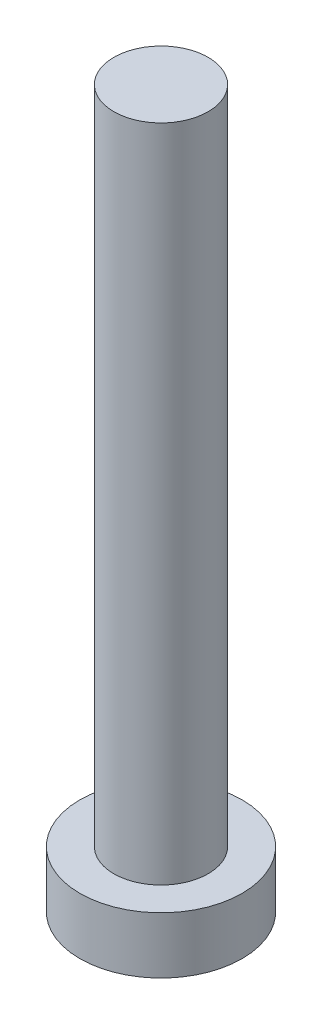
ISO-10303-21;
HEADER;
FILE_DESCRIPTION(('STEP AP214'),'2;1');
FILE_NAME('part.step','',(''),(''),'','','');
FILE_SCHEMA(('AUTOMOTIVE_DESIGN { 1 0 10303 214 1 1 1 1 }'));
ENDSEC;
DATA;
#1=APPLICATION_CONTEXT('core data for automotive mechanical design processes');
#2=APPLICATION_PROTOCOL_DEFINITION('international standard','automotive_design',2000,#1);
#3=PRODUCT_CONTEXT('',#1,'mechanical');
#4=PRODUCT('Part','Part','',(#3));
#5=PRODUCT_RELATED_PRODUCT_CATEGORY('part','',(#4));
#6=PRODUCT_DEFINITION_FORMATION('','',#4);
#7=PRODUCT_DEFINITION_CONTEXT('part definition',#1,'design');
#8=PRODUCT_DEFINITION('design','',#6,#7);
#9=PRODUCT_DEFINITION_SHAPE('','',#8);
#10=(LENGTH_UNIT() NAMED_UNIT(*) SI_UNIT(.MILLI.,.METRE.));
#11=(NAMED_UNIT(*) PLANE_ANGLE_UNIT() SI_UNIT($,.RADIAN.));
#12=(NAMED_UNIT(*) SI_UNIT($,.STERADIAN.) SOLID_ANGLE_UNIT());
#13=UNCERTAINTY_MEASURE_WITH_UNIT(LENGTH_MEASURE(1.E-05),#10,'distance_accuracy_value','');
#14=(GEOMETRIC_REPRESENTATION_CONTEXT(3) GLOBAL_UNCERTAINTY_ASSIGNED_CONTEXT((#13)) GLOBAL_UNIT_ASSIGNED_CONTEXT((#10,
#11,#12)) REPRESENTATION_CONTEXT('',''));
#15=CARTESIAN_POINT('',(0.,0.,0.));
#16=DIRECTION('',(0.,0.,1.));
#17=DIRECTION('',(1.,0.,0.));
#18=AXIS2_PLACEMENT_3D('',#15,#16,#17);
#19=CARTESIAN_POINT('',(0.,0.,0.));
#20=DIRECTION('',(0.,1.,0.));
#21=DIRECTION('',(0.,0.,1.));
#22=AXIS2_PLACEMENT_3D('',#19,#20,#21);
#23=PLANE('',#22);
#24=CARTESIAN_POINT('',(0.,0.,0.));
#25=DIRECTION('',(0.,1.,0.));
#26=DIRECTION('',(0.,0.,1.));
#27=AXIS2_PLACEMENT_3D('',#24,#25,#26);
#28=CIRCLE('',#27,4.3);
#29=CARTESIAN_POINT('',(0.,0.,4.3));
#30=VERTEX_POINT('',#29);
#31=EDGE_CURVE('E39',#30,#30,#28,.T.);
#32=ORIENTED_EDGE('',*,*,#31,.F.);
#33=EDGE_LOOP('',(#32));
#34=FACE_BOUND('',#33,.T.);
#35=CARTESIAN_POINT('',(1.1,0.,1.1));
#36=DIRECTION('',(0.,1.,0.));
#37=DIRECTION('',(0.,0.,-1.));
#38=AXIS2_PLACEMENT_3D('',#35,#36,#37);
#39=CIRCLE('',#38,0.5);
#40=CARTESIAN_POINT('',(1.1,0.,0.6));
#41=VERTEX_POINT('',#40);
#42=CARTESIAN_POINT('',(0.6,0.,1.1));
#43=VERTEX_POINT('',#42);
#44=EDGE_CURVE('E186',#41,#43,#39,.T.);
#45=ORIENTED_EDGE('',*,*,#44,.F.);
#46=DIRECTION('',(-1.,0.,0.));
#47=VECTOR('',#46,1.);
#48=CARTESIAN_POINT('',(1.1,0.,0.6));
#49=LINE('',#48,#47);
#50=CARTESIAN_POINT('',(2.4,0.,0.6));
#51=VERTEX_POINT('',#50);
#52=EDGE_CURVE('E52',#51,#41,#49,.T.);
#53=ORIENTED_EDGE('',*,*,#52,.F.);
#54=DIRECTION('',(0.,0.,1.));
#55=VECTOR('',#54,1.);
#56=CARTESIAN_POINT('',(2.4,0.,-0.6));
#57=LINE('',#56,#55);
#58=CARTESIAN_POINT('',(2.4,0.,-0.6));
#59=VERTEX_POINT('',#58);
#60=EDGE_CURVE('E225',#59,#51,#57,.T.);
#61=ORIENTED_EDGE('',*,*,#60,.F.);
#62=DIRECTION('',(1.,0.,0.));
#63=VECTOR('',#62,1.);
#64=CARTESIAN_POINT('',(1.1,0.,-0.6));
#65=LINE('',#64,#63);
#66=CARTESIAN_POINT('',(1.1,0.,-0.6));
#67=VERTEX_POINT('',#66);
#68=EDGE_CURVE('E223',#67,#59,#65,.T.);
#69=ORIENTED_EDGE('',*,*,#68,.F.);
#70=CARTESIAN_POINT('',(1.1,0.,-1.1));
#71=DIRECTION('',(0.,1.,0.));
#72=DIRECTION('',(0.,0.,-1.));
#73=AXIS2_PLACEMENT_3D('',#70,#71,#72);
#74=CIRCLE('',#73,0.5);
#75=CARTESIAN_POINT('',(0.600000000000001,0.,-1.1));
#76=VERTEX_POINT('',#75);
#77=EDGE_CURVE('E160',#76,#67,#74,.T.);
#78=ORIENTED_EDGE('',*,*,#77,.F.);
#79=DIRECTION('',(0.,0.,1.));
#80=VECTOR('',#79,1.);
#81=CARTESIAN_POINT('',(0.600000000000001,0.,-2.4));
#82=LINE('',#81,#80);
#83=CARTESIAN_POINT('',(0.600000000000001,0.,-2.4));
#84=VERTEX_POINT('',#83);
#85=EDGE_CURVE('E219',#84,#76,#82,.T.);
#86=ORIENTED_EDGE('',*,*,#85,.F.);
#87=DIRECTION('',(1.,0.,0.));
#88=VECTOR('',#87,1.);
#89=CARTESIAN_POINT('',(-0.599999999999999,0.,-2.4));
#90=LINE('',#89,#88);
#91=CARTESIAN_POINT('',(-0.599999999999999,0.,-2.4));
#92=VERTEX_POINT('',#91);
#93=EDGE_CURVE('E216',#92,#84,#90,.T.);
#94=ORIENTED_EDGE('',*,*,#93,.F.);
#95=DIRECTION('',(0.,0.,-1.));
#96=VECTOR('',#95,1.);
#97=CARTESIAN_POINT('',(-0.599999999999999,0.,-2.4));
#98=LINE('',#97,#96);
#99=CARTESIAN_POINT('',(-0.599999999999999,0.,-1.1));
#100=VERTEX_POINT('',#99);
#101=EDGE_CURVE('E213',#100,#92,#98,.T.);
#102=ORIENTED_EDGE('',*,*,#101,.F.);
#103=CARTESIAN_POINT('',(-1.1,0.,-1.1));
#104=DIRECTION('',(0.,1.,0.));
#105=DIRECTION('',(0.,0.,-1.));
#106=AXIS2_PLACEMENT_3D('',#103,#104,#105);
#107=CIRCLE('',#106,0.5);
#108=CARTESIAN_POINT('',(-1.1,0.,-0.6));
#109=VERTEX_POINT('',#108);
#110=EDGE_CURVE('E210',#109,#100,#107,.T.);
#111=ORIENTED_EDGE('',*,*,#110,.F.);
#112=DIRECTION('',(1.,0.,0.));
#113=VECTOR('',#112,1.);
#114=CARTESIAN_POINT('',(-2.4,0.,-0.6));
#115=LINE('',#114,#113);
#116=CARTESIAN_POINT('',(-2.4,0.,-0.6));
#117=VERTEX_POINT('',#116);
#118=EDGE_CURVE('E207',#117,#109,#115,.T.);
#119=ORIENTED_EDGE('',*,*,#118,.F.);
#120=DIRECTION('',(0.,0.,-1.));
#121=VECTOR('',#120,1.);
#122=CARTESIAN_POINT('',(-2.4,0.,-0.6));
#123=LINE('',#122,#121);
#124=CARTESIAN_POINT('',(-2.4,0.,0.6));
#125=VERTEX_POINT('',#124);
#126=EDGE_CURVE('E204',#125,#117,#123,.T.);
#127=ORIENTED_EDGE('',*,*,#126,.F.);
#128=DIRECTION('',(-1.,0.,0.));
#129=VECTOR('',#128,1.);
#130=CARTESIAN_POINT('',(-2.4,0.,0.6));
#131=LINE('',#130,#129);
#132=CARTESIAN_POINT('',(-1.1,0.,0.6));
#133=VERTEX_POINT('',#132);
#134=EDGE_CURVE('E201',#133,#125,#131,.T.);
#135=ORIENTED_EDGE('',*,*,#134,.F.);
#136=CARTESIAN_POINT('',(-1.1,0.,1.1));
#137=DIRECTION('',(0.,1.,0.));
#138=DIRECTION('',(0.,0.,1.));
#139=AXIS2_PLACEMENT_3D('',#136,#137,#138);
#140=CIRCLE('',#139,0.5);
#141=CARTESIAN_POINT('',(-0.599999999999999,0.,1.1));
#142=VERTEX_POINT('',#141);
#143=EDGE_CURVE('E198',#142,#133,#140,.T.);
#144=ORIENTED_EDGE('',*,*,#143,.F.);
#145=DIRECTION('',(0.,0.,-1.));
#146=VECTOR('',#145,1.);
#147=CARTESIAN_POINT('',(-0.599999999999999,0.,1.1));
#148=LINE('',#147,#146);
#149=CARTESIAN_POINT('',(-0.599999999999999,0.,2.4));
#150=VERTEX_POINT('',#149);
#151=EDGE_CURVE('E195',#150,#142,#148,.T.);
#152=ORIENTED_EDGE('',*,*,#151,.F.);
#153=DIRECTION('',(-1.,0.,0.));
#154=VECTOR('',#153,1.);
#155=CARTESIAN_POINT('',(-0.599999999999999,0.,2.4));
#156=LINE('',#155,#154);
#157=CARTESIAN_POINT('',(0.600000000000001,0.,2.4));
#158=VERTEX_POINT('',#157);
#159=EDGE_CURVE('E192',#158,#150,#156,.T.);
#160=ORIENTED_EDGE('',*,*,#159,.F.);
#161=DIRECTION('',(0.,0.,1.));
#162=VECTOR('',#161,1.);
#163=CARTESIAN_POINT('',(0.6,0.,1.1));
#164=LINE('',#163,#162);
#165=EDGE_CURVE('E189',#43,#158,#164,.T.);
#166=ORIENTED_EDGE('',*,*,#165,.F.);
#167=EDGE_LOOP('',(#45,#53,#61,#69,#78,#86,#94,#102,#111,#119,#127,#135,#144,#152,#160,#166));
#168=FACE_BOUND('',#167,.T.);
#169=ADVANCED_FACE('F35',(#34,#168),#23,.F.);
#170=CARTESIAN_POINT('',(0.,3.,0.));
#171=DIRECTION('',(0.,-1.,0.));
#172=DIRECTION('',(0.,0.,-1.));
#173=AXIS2_PLACEMENT_3D('',#170,#171,#172);
#174=CYLINDRICAL_SURFACE('',#173,4.3);
#175=CARTESIAN_POINT('',(0.,3.,0.));
#176=DIRECTION('',(0.,1.,0.));
#177=DIRECTION('',(0.,0.,1.));
#178=AXIS2_PLACEMENT_3D('',#175,#176,#177);
#179=CIRCLE('',#178,4.3);
#180=CARTESIAN_POINT('',(0.,3.,4.3));
#181=VERTEX_POINT('',#180);
#182=EDGE_CURVE('E44',#181,#181,#179,.T.);
#183=ORIENTED_EDGE('',*,*,#182,.F.);
#184=EDGE_LOOP('',(#183));
#185=FACE_BOUND('',#184,.T.);
#186=ORIENTED_EDGE('',*,*,#31,.T.);
#187=EDGE_LOOP('',(#186));
#188=FACE_BOUND('',#187,.T.);
#189=ADVANCED_FACE('F37',(#185,#188),#174,.T.);
#190=CARTESIAN_POINT('',(0.,3.,0.));
#191=DIRECTION('',(0.,1.,0.));
#192=DIRECTION('',(0.,0.,1.));
#193=AXIS2_PLACEMENT_3D('',#190,#191,#192);
#194=PLANE('',#193);
#195=CARTESIAN_POINT('',(0.,3.,0.));
#196=DIRECTION('',(0.,1.,0.));
#197=DIRECTION('',(0.,0.,1.));
#198=AXIS2_PLACEMENT_3D('',#195,#196,#197);
#199=CIRCLE('',#198,2.5);
#200=CARTESIAN_POINT('',(0.,3.,2.5));
#201=VERTEX_POINT('',#200);
#202=EDGE_CURVE('E11',#201,#201,#199,.T.);
#203=ORIENTED_EDGE('',*,*,#202,.F.);
#204=EDGE_LOOP('',(#203));
#205=FACE_BOUND('',#204,.T.);
#206=ORIENTED_EDGE('',*,*,#182,.T.);
#207=EDGE_LOOP('',(#206));
#208=FACE_BOUND('',#207,.T.);
#209=ADVANCED_FACE('F374',(#205,#208),#194,.T.);
#210=CARTESIAN_POINT('',(0.,38.,0.));
#211=DIRECTION('',(0.,-1.,0.));
#212=DIRECTION('',(0.,0.,-1.));
#213=AXIS2_PLACEMENT_3D('',#210,#211,#212);
#214=CYLINDRICAL_SURFACE('',#213,2.5);
#215=CARTESIAN_POINT('',(0.,38.,0.));
#216=DIRECTION('',(0.,1.,0.));
#217=DIRECTION('',(0.,0.,1.));
#218=AXIS2_PLACEMENT_3D('',#215,#216,#217);
#219=CIRCLE('',#218,2.5);
#220=CARTESIAN_POINT('',(0.,38.,2.5));
#221=VERTEX_POINT('',#220);
#222=EDGE_CURVE('E229',#221,#221,#219,.T.);
#223=ORIENTED_EDGE('',*,*,#222,.F.);
#224=EDGE_LOOP('',(#223));
#225=FACE_BOUND('',#224,.T.);
#226=ORIENTED_EDGE('',*,*,#202,.T.);
#227=EDGE_LOOP('',(#226));
#228=FACE_BOUND('',#227,.T.);
#229=ADVANCED_FACE('F370',(#225,#228),#214,.T.);
#230=CARTESIAN_POINT('',(0.,38.,0.));
#231=DIRECTION('',(0.,1.,0.));
#232=DIRECTION('',(0.,0.,1.));
#233=AXIS2_PLACEMENT_3D('',#230,#231,#232);
#234=PLANE('',#233);
#235=ORIENTED_EDGE('',*,*,#222,.T.);
#236=EDGE_LOOP('',(#235));
#237=FACE_BOUND('',#236,.T.);
#238=ADVANCED_FACE('F320',(#237),#234,.T.);
#239=CARTESIAN_POINT('',(1.1,1.5,0.6));
#240=DIRECTION('',(0.,0.,1.));
#241=DIRECTION('',(1.,0.,0.));
#242=AXIS2_PLACEMENT_3D('',#239,#240,#241);
#243=PLANE('',#242);
#244=ORIENTED_EDGE('',*,*,#52,.T.);
#245=DIRECTION('',(0.,-1.,0.));
#246=VECTOR('',#245,1.);
#247=CARTESIAN_POINT('',(1.1,1.5,0.6));
#248=LINE('',#247,#246);
#249=CARTESIAN_POINT('',(1.1,1.5,0.6));
#250=VERTEX_POINT('',#249);
#251=EDGE_CURVE('E112',#250,#41,#248,.T.);
#252=ORIENTED_EDGE('',*,*,#251,.F.);
#253=DIRECTION('',(-1.,0.,0.));
#254=VECTOR('',#253,1.);
#255=CARTESIAN_POINT('',(1.1,1.5,0.6));
#256=LINE('',#255,#254);
#257=CARTESIAN_POINT('',(2.4,1.5,0.6));
#258=VERTEX_POINT('',#257);
#259=EDGE_CURVE('E227',#258,#250,#256,.T.);
#260=ORIENTED_EDGE('',*,*,#259,.F.);
#261=DIRECTION('',(0.,-1.,0.));
#262=VECTOR('',#261,1.);
#263=CARTESIAN_POINT('',(2.4,1.5,0.6));
#264=LINE('',#263,#262);
#265=EDGE_CURVE('E60',#258,#51,#264,.T.);
#266=ORIENTED_EDGE('',*,*,#265,.T.);
#267=EDGE_LOOP('',(#244,#252,#260,#266));
#268=FACE_BOUND('',#267,.T.);
#269=ADVANCED_FACE('F313',(#268),#243,.F.);
#270=CARTESIAN_POINT('',(2.4,1.5,-0.6));
#271=DIRECTION('',(1.,0.,0.));
#272=DIRECTION('',(0.,0.,-1.));
#273=AXIS2_PLACEMENT_3D('',#270,#271,#272);
#274=PLANE('',#273);
#275=ORIENTED_EDGE('',*,*,#60,.T.);
#276=ORIENTED_EDGE('',*,*,#265,.F.);
#277=DIRECTION('',(0.,0.,1.));
#278=VECTOR('',#277,1.);
#279=CARTESIAN_POINT('',(2.4,1.5,-0.6));
#280=LINE('',#279,#278);
#281=CARTESIAN_POINT('',(2.4,1.5,-0.6));
#282=VERTEX_POINT('',#281);
#283=EDGE_CURVE('E172',#282,#258,#280,.T.);
#284=ORIENTED_EDGE('',*,*,#283,.F.);
#285=DIRECTION('',(0.,-1.,0.));
#286=VECTOR('',#285,1.);
#287=CARTESIAN_POINT('',(2.4,1.5,-0.6));
#288=LINE('',#287,#286);
#289=EDGE_CURVE('E164',#282,#59,#288,.T.);
#290=ORIENTED_EDGE('',*,*,#289,.T.);
#291=EDGE_LOOP('',(#275,#276,#284,#290));
#292=FACE_BOUND('',#291,.T.);
#293=ADVANCED_FACE('F311',(#292),#274,.F.);
#294=CARTESIAN_POINT('',(1.1,1.5,-0.6));
#295=DIRECTION('',(0.,0.,-1.));
#296=DIRECTION('',(-1.,0.,0.));
#297=AXIS2_PLACEMENT_3D('',#294,#295,#296);
#298=PLANE('',#297);
#299=ORIENTED_EDGE('',*,*,#68,.T.);
#300=ORIENTED_EDGE('',*,*,#289,.F.);
#301=DIRECTION('',(1.,0.,0.));
#302=VECTOR('',#301,1.);
#303=CARTESIAN_POINT('',(1.1,1.5,-0.6));
#304=LINE('',#303,#302);
#305=CARTESIAN_POINT('',(1.1,1.5,-0.6));
#306=VERTEX_POINT('',#305);
#307=EDGE_CURVE('E168',#306,#282,#304,.T.);
#308=ORIENTED_EDGE('',*,*,#307,.F.);
#309=DIRECTION('',(0.,-1.,0.));
#310=VECTOR('',#309,1.);
#311=CARTESIAN_POINT('',(1.1,1.5,-0.6));
#312=LINE('',#311,#310);
#313=EDGE_CURVE('E153',#306,#67,#312,.T.);
#314=ORIENTED_EDGE('',*,*,#313,.T.);
#315=EDGE_LOOP('',(#299,#300,#308,#314));
#316=FACE_BOUND('',#315,.T.);
#317=ADVANCED_FACE('F169',(#316),#298,.F.);
#318=CARTESIAN_POINT('',(1.1,1.5,-1.1));
#319=DIRECTION('',(0.,-1.,0.));
#320=DIRECTION('',(0.,0.,-1.));
#321=AXIS2_PLACEMENT_3D('',#318,#319,#320);
#322=CYLINDRICAL_SURFACE('',#321,0.5);
#323=ORIENTED_EDGE('',*,*,#77,.T.);
#324=ORIENTED_EDGE('',*,*,#313,.F.);
#325=CARTESIAN_POINT('',(1.1,1.5,-1.1));
#326=DIRECTION('',(0.,1.,0.));
#327=DIRECTION('',(0.,0.,-1.));
#328=AXIS2_PLACEMENT_3D('',#325,#326,#327);
#329=CIRCLE('',#328,0.5);
#330=CARTESIAN_POINT('',(0.600000000000001,1.5,-1.1));
#331=VERTEX_POINT('',#330);
#332=EDGE_CURVE('E157',#331,#306,#329,.T.);
#333=ORIENTED_EDGE('',*,*,#332,.F.);
#334=DIRECTION('',(0.,-1.,0.));
#335=VECTOR('',#334,1.);
#336=CARTESIAN_POINT('',(0.600000000000001,1.5,-1.1));
#337=LINE('',#336,#335);
#338=EDGE_CURVE('E165',#331,#76,#337,.T.);
#339=ORIENTED_EDGE('',*,*,#338,.T.);
#340=EDGE_LOOP('',(#323,#324,#333,#339));
#341=FACE_BOUND('',#340,.T.);
#342=ADVANCED_FACE('F155',(#341),#322,.T.);
#343=CARTESIAN_POINT('',(0.600000000000001,1.5,-2.4));
#344=DIRECTION('',(1.,0.,0.));
#345=DIRECTION('',(0.,0.,-1.));
#346=AXIS2_PLACEMENT_3D('',#343,#344,#345);
#347=PLANE('',#346);
#348=ORIENTED_EDGE('',*,*,#85,.T.);
#349=ORIENTED_EDGE('',*,*,#338,.F.);
#350=DIRECTION('',(0.,0.,1.));
#351=VECTOR('',#350,1.);
#352=CARTESIAN_POINT('',(0.600000000000001,1.5,-2.4));
#353=LINE('',#352,#351);
#354=CARTESIAN_POINT('',(0.600000000000001,1.5,-2.4));
#355=VERTEX_POINT('',#354);
#356=EDGE_CURVE('E178',#355,#331,#353,.T.);
#357=ORIENTED_EDGE('',*,*,#356,.F.);
#358=DIRECTION('',(0.,-1.,0.));
#359=VECTOR('',#358,1.);
#360=CARTESIAN_POINT('',(0.600000000000001,1.5,-2.4));
#361=LINE('',#360,#359);
#362=EDGE_CURVE('E232',#355,#84,#361,.T.);
#363=ORIENTED_EDGE('',*,*,#362,.T.);
#364=EDGE_LOOP('',(#348,#349,#357,#363));
#365=FACE_BOUND('',#364,.T.);
#366=ADVANCED_FACE('F310',(#365),#347,.F.);
#367=CARTESIAN_POINT('',(-0.599999999999999,1.5,-2.4));
#368=DIRECTION('',(0.,0.,-1.));
#369=DIRECTION('',(-1.,0.,0.));
#370=AXIS2_PLACEMENT_3D('',#367,#368,#369);
#371=PLANE('',#370);
#372=ORIENTED_EDGE('',*,*,#93,.T.);
#373=ORIENTED_EDGE('',*,*,#362,.F.);
#374=DIRECTION('',(1.,0.,0.));
#375=VECTOR('',#374,1.);
#376=CARTESIAN_POINT('',(-0.599999999999999,1.5,-2.4));
#377=LINE('',#376,#375);
#378=CARTESIAN_POINT('',(-0.599999999999999,1.5,-2.4));
#379=VERTEX_POINT('',#378);
#380=EDGE_CURVE('E180',#379,#355,#377,.T.);
#381=ORIENTED_EDGE('',*,*,#380,.F.);
#382=DIRECTION('',(0.,-1.,0.));
#383=VECTOR('',#382,1.);
#384=CARTESIAN_POINT('',(-0.599999999999999,1.5,-2.4));
#385=LINE('',#384,#383);
#386=EDGE_CURVE('E234',#379,#92,#385,.T.);
#387=ORIENTED_EDGE('',*,*,#386,.T.);
#388=EDGE_LOOP('',(#372,#373,#381,#387));
#389=FACE_BOUND('',#388,.T.);
#390=ADVANCED_FACE('F306',(#389),#371,.F.);
#391=CARTESIAN_POINT('',(-0.599999999999999,1.5,-2.4));
#392=DIRECTION('',(-1.,0.,0.));
#393=DIRECTION('',(0.,0.,1.));
#394=AXIS2_PLACEMENT_3D('',#391,#392,#393);
#395=PLANE('',#394);
#396=ORIENTED_EDGE('',*,*,#101,.T.);
#397=ORIENTED_EDGE('',*,*,#386,.F.);
#398=DIRECTION('',(0.,0.,-1.));
#399=VECTOR('',#398,1.);
#400=CARTESIAN_POINT('',(-0.599999999999999,1.5,-2.4));
#401=LINE('',#400,#399);
#402=CARTESIAN_POINT('',(-0.599999999999999,1.5,-1.1));
#403=VERTEX_POINT('',#402);
#404=EDGE_CURVE('E301',#403,#379,#401,.T.);
#405=ORIENTED_EDGE('',*,*,#404,.F.);
#406=DIRECTION('',(0.,-1.,0.));
#407=VECTOR('',#406,1.);
#408=CARTESIAN_POINT('',(-0.599999999999999,1.5,-1.1));
#409=LINE('',#408,#407);
#410=EDGE_CURVE('E236',#403,#100,#409,.T.);
#411=ORIENTED_EDGE('',*,*,#410,.T.);
#412=EDGE_LOOP('',(#396,#397,#405,#411));
#413=FACE_BOUND('',#412,.T.);
#414=ADVANCED_FACE('F330',(#413),#395,.F.);
#415=CARTESIAN_POINT('',(-1.1,1.5,-1.1));
#416=DIRECTION('',(0.,-1.,0.));
#417=DIRECTION('',(0.,0.,-1.));
#418=AXIS2_PLACEMENT_3D('',#415,#416,#417);
#419=CYLINDRICAL_SURFACE('',#418,0.5);
#420=ORIENTED_EDGE('',*,*,#110,.T.);
#421=ORIENTED_EDGE('',*,*,#410,.F.);
#422=CARTESIAN_POINT('',(-1.1,1.5,-1.1));
#423=DIRECTION('',(0.,1.,0.));
#424=DIRECTION('',(0.,0.,-1.));
#425=AXIS2_PLACEMENT_3D('',#422,#423,#424);
#426=CIRCLE('',#425,0.5);
#427=CARTESIAN_POINT('',(-1.1,1.5,-0.6));
#428=VERTEX_POINT('',#427);
#429=EDGE_CURVE('E298',#428,#403,#426,.T.);
#430=ORIENTED_EDGE('',*,*,#429,.F.);
#431=DIRECTION('',(0.,-1.,0.));
#432=VECTOR('',#431,1.);
#433=CARTESIAN_POINT('',(-1.1,1.5,-0.6));
#434=LINE('',#433,#432);
#435=EDGE_CURVE('E238',#428,#109,#434,.T.);
#436=ORIENTED_EDGE('',*,*,#435,.T.);
#437=EDGE_LOOP('',(#420,#421,#430,#436));
#438=FACE_BOUND('',#437,.T.);
#439=ADVANCED_FACE('F333',(#438),#419,.T.);
#440=CARTESIAN_POINT('',(-2.4,1.5,-0.6));
#441=DIRECTION('',(0.,0.,-1.));
#442=DIRECTION('',(-1.,0.,0.));
#443=AXIS2_PLACEMENT_3D('',#440,#441,#442);
#444=PLANE('',#443);
#445=ORIENTED_EDGE('',*,*,#118,.T.);
#446=ORIENTED_EDGE('',*,*,#435,.F.);
#447=DIRECTION('',(1.,0.,0.));
#448=VECTOR('',#447,1.);
#449=CARTESIAN_POINT('',(-2.4,1.5,-0.6));
#450=LINE('',#449,#448);
#451=CARTESIAN_POINT('',(-2.4,1.5,-0.6));
#452=VERTEX_POINT('',#451);
#453=EDGE_CURVE('E295',#452,#428,#450,.T.);
#454=ORIENTED_EDGE('',*,*,#453,.F.);
#455=DIRECTION('',(0.,-1.,0.));
#456=VECTOR('',#455,1.);
#457=CARTESIAN_POINT('',(-2.4,1.5,-0.6));
#458=LINE('',#457,#456);
#459=EDGE_CURVE('E240',#452,#117,#458,.T.);
#460=ORIENTED_EDGE('',*,*,#459,.T.);
#461=EDGE_LOOP('',(#445,#446,#454,#460));
#462=FACE_BOUND('',#461,.T.);
#463=ADVANCED_FACE('F337',(#462),#444,.F.);
#464=CARTESIAN_POINT('',(-2.4,1.5,-0.6));
#465=DIRECTION('',(-1.,0.,0.));
#466=DIRECTION('',(0.,0.,1.));
#467=AXIS2_PLACEMENT_3D('',#464,#465,#466);
#468=PLANE('',#467);
#469=ORIENTED_EDGE('',*,*,#126,.T.);
#470=ORIENTED_EDGE('',*,*,#459,.F.);
#471=DIRECTION('',(0.,0.,-1.));
#472=VECTOR('',#471,1.);
#473=CARTESIAN_POINT('',(-2.4,1.5,-0.6));
#474=LINE('',#473,#472);
#475=CARTESIAN_POINT('',(-2.4,1.5,0.6));
#476=VERTEX_POINT('',#475);
#477=EDGE_CURVE('E292',#476,#452,#474,.T.);
#478=ORIENTED_EDGE('',*,*,#477,.F.);
#479=DIRECTION('',(0.,-1.,0.));
#480=VECTOR('',#479,1.);
#481=CARTESIAN_POINT('',(-2.4,1.5,0.6));
#482=LINE('',#481,#480);
#483=EDGE_CURVE('E242',#476,#125,#482,.T.);
#484=ORIENTED_EDGE('',*,*,#483,.T.);
#485=EDGE_LOOP('',(#469,#470,#478,#484));
#486=FACE_BOUND('',#485,.T.);
#487=ADVANCED_FACE('F341',(#486),#468,.F.);
#488=CARTESIAN_POINT('',(-2.4,1.5,0.6));
#489=DIRECTION('',(0.,0.,1.));
#490=DIRECTION('',(1.,0.,0.));
#491=AXIS2_PLACEMENT_3D('',#488,#489,#490);
#492=PLANE('',#491);
#493=ORIENTED_EDGE('',*,*,#134,.T.);
#494=ORIENTED_EDGE('',*,*,#483,.F.);
#495=DIRECTION('',(-1.,0.,0.));
#496=VECTOR('',#495,1.);
#497=CARTESIAN_POINT('',(-2.4,1.5,0.6));
#498=LINE('',#497,#496);
#499=CARTESIAN_POINT('',(-1.1,1.5,0.6));
#500=VERTEX_POINT('',#499);
#501=EDGE_CURVE('E289',#500,#476,#498,.T.);
#502=ORIENTED_EDGE('',*,*,#501,.F.);
#503=DIRECTION('',(0.,-1.,0.));
#504=VECTOR('',#503,1.);
#505=CARTESIAN_POINT('',(-1.1,1.5,0.6));
#506=LINE('',#505,#504);
#507=EDGE_CURVE('E244',#500,#133,#506,.T.);
#508=ORIENTED_EDGE('',*,*,#507,.T.);
#509=EDGE_LOOP('',(#493,#494,#502,#508));
#510=FACE_BOUND('',#509,.T.);
#511=ADVANCED_FACE('F345',(#510),#492,.F.);
#512=CARTESIAN_POINT('',(-1.1,1.5,1.1));
#513=DIRECTION('',(0.,-1.,0.));
#514=DIRECTION('',(0.,0.,-1.));
#515=AXIS2_PLACEMENT_3D('',#512,#513,#514);
#516=CYLINDRICAL_SURFACE('',#515,0.5);
#517=ORIENTED_EDGE('',*,*,#143,.T.);
#518=ORIENTED_EDGE('',*,*,#507,.F.);
#519=CARTESIAN_POINT('',(-1.1,1.5,1.1));
#520=DIRECTION('',(0.,1.,0.));
#521=DIRECTION('',(0.,0.,1.));
#522=AXIS2_PLACEMENT_3D('',#519,#520,#521);
#523=CIRCLE('',#522,0.5);
#524=CARTESIAN_POINT('',(-0.599999999999999,1.5,1.1));
#525=VERTEX_POINT('',#524);
#526=EDGE_CURVE('E286',#525,#500,#523,.T.);
#527=ORIENTED_EDGE('',*,*,#526,.F.);
#528=DIRECTION('',(0.,-1.,0.));
#529=VECTOR('',#528,1.);
#530=CARTESIAN_POINT('',(-0.599999999999999,1.5,1.1));
#531=LINE('',#530,#529);
#532=EDGE_CURVE('E246',#525,#142,#531,.T.);
#533=ORIENTED_EDGE('',*,*,#532,.T.);
#534=EDGE_LOOP('',(#517,#518,#527,#533));
#535=FACE_BOUND('',#534,.T.);
#536=ADVANCED_FACE('F349',(#535),#516,.T.);
#537=CARTESIAN_POINT('',(-0.599999999999999,1.5,1.1));
#538=DIRECTION('',(-1.,0.,0.));
#539=DIRECTION('',(0.,0.,1.));
#540=AXIS2_PLACEMENT_3D('',#537,#538,#539);
#541=PLANE('',#540);
#542=ORIENTED_EDGE('',*,*,#151,.T.);
#543=ORIENTED_EDGE('',*,*,#532,.F.);
#544=DIRECTION('',(0.,0.,-1.));
#545=VECTOR('',#544,1.);
#546=CARTESIAN_POINT('',(-0.599999999999999,1.5,1.1));
#547=LINE('',#546,#545);
#548=CARTESIAN_POINT('',(-0.599999999999999,1.5,2.4));
#549=VERTEX_POINT('',#548);
#550=EDGE_CURVE('E283',#549,#525,#547,.T.);
#551=ORIENTED_EDGE('',*,*,#550,.F.);
#552=DIRECTION('',(0.,-1.,0.));
#553=VECTOR('',#552,1.);
#554=CARTESIAN_POINT('',(-0.599999999999999,1.5,2.4));
#555=LINE('',#554,#553);
#556=EDGE_CURVE('E248',#549,#150,#555,.T.);
#557=ORIENTED_EDGE('',*,*,#556,.T.);
#558=EDGE_LOOP('',(#542,#543,#551,#557));
#559=FACE_BOUND('',#558,.T.);
#560=ADVANCED_FACE('F353',(#559),#541,.F.);
#561=CARTESIAN_POINT('',(-0.599999999999999,1.5,2.4));
#562=DIRECTION('',(0.,0.,1.));
#563=DIRECTION('',(1.,0.,0.));
#564=AXIS2_PLACEMENT_3D('',#561,#562,#563);
#565=PLANE('',#564);
#566=ORIENTED_EDGE('',*,*,#159,.T.);
#567=ORIENTED_EDGE('',*,*,#556,.F.);
#568=DIRECTION('',(-1.,0.,0.));
#569=VECTOR('',#568,1.);
#570=CARTESIAN_POINT('',(-0.599999999999999,1.5,2.4));
#571=LINE('',#570,#569);
#572=CARTESIAN_POINT('',(0.600000000000001,1.5,2.4));
#573=VERTEX_POINT('',#572);
#574=EDGE_CURVE('E280',#573,#549,#571,.T.);
#575=ORIENTED_EDGE('',*,*,#574,.F.);
#576=DIRECTION('',(0.,-1.,0.));
#577=VECTOR('',#576,1.);
#578=CARTESIAN_POINT('',(0.600000000000001,1.5,2.4));
#579=LINE('',#578,#577);
#580=EDGE_CURVE('E250',#573,#158,#579,.T.);
#581=ORIENTED_EDGE('',*,*,#580,.T.);
#582=EDGE_LOOP('',(#566,#567,#575,#581));
#583=FACE_BOUND('',#582,.T.);
#584=ADVANCED_FACE('F357',(#583),#565,.F.);
#585=CARTESIAN_POINT('',(0.6,1.5,1.1));
#586=DIRECTION('',(1.,0.,0.));
#587=DIRECTION('',(0.,0.,-1.));
#588=AXIS2_PLACEMENT_3D('',#585,#586,#587);
#589=PLANE('',#588);
#590=ORIENTED_EDGE('',*,*,#165,.T.);
#591=ORIENTED_EDGE('',*,*,#580,.F.);
#592=DIRECTION('',(0.,0.,1.));
#593=VECTOR('',#592,1.);
#594=CARTESIAN_POINT('',(0.6,1.5,1.1));
#595=LINE('',#594,#593);
#596=CARTESIAN_POINT('',(0.6,1.5,1.1));
#597=VERTEX_POINT('',#596);
#598=EDGE_CURVE('E275',#597,#573,#595,.T.);
#599=ORIENTED_EDGE('',*,*,#598,.F.);
#600=DIRECTION('',(0.,-1.,0.));
#601=VECTOR('',#600,1.);
#602=CARTESIAN_POINT('',(0.6,1.5,1.1));
#603=LINE('',#602,#601);
#604=EDGE_CURVE('E252',#597,#43,#603,.T.);
#605=ORIENTED_EDGE('',*,*,#604,.T.);
#606=EDGE_LOOP('',(#590,#591,#599,#605));
#607=FACE_BOUND('',#606,.T.);
#608=ADVANCED_FACE('F361',(#607),#589,.F.);
#609=CARTESIAN_POINT('',(1.1,1.5,1.1));
#610=DIRECTION('',(0.,-1.,0.));
#611=DIRECTION('',(0.,0.,-1.));
#612=AXIS2_PLACEMENT_3D('',#609,#610,#611);
#613=CYLINDRICAL_SURFACE('',#612,0.5);
#614=ORIENTED_EDGE('',*,*,#44,.T.);
#615=ORIENTED_EDGE('',*,*,#604,.F.);
#616=CARTESIAN_POINT('',(1.1,1.5,1.1));
#617=DIRECTION('',(0.,1.,0.));
#618=DIRECTION('',(0.,0.,-1.));
#619=AXIS2_PLACEMENT_3D('',#616,#617,#618);
#620=CIRCLE('',#619,0.5);
#621=EDGE_CURVE('E273',#250,#597,#620,.T.);
#622=ORIENTED_EDGE('',*,*,#621,.F.);
#623=ORIENTED_EDGE('',*,*,#251,.T.);
#624=EDGE_LOOP('',(#614,#615,#622,#623));
#625=FACE_BOUND('',#624,.T.);
#626=ADVANCED_FACE('F270',(#625),#613,.T.);
#627=CARTESIAN_POINT('',(1.1,1.5,-1.1));
#628=DIRECTION('',(0.,-1.,0.));
#629=DIRECTION('',(0.,0.,-1.));
#630=AXIS2_PLACEMENT_3D('',#627,#628,#629);
#631=PLANE('',#630);
#632=ORIENTED_EDGE('',*,*,#259,.T.);
#633=ORIENTED_EDGE('',*,*,#621,.T.);
#634=ORIENTED_EDGE('',*,*,#598,.T.);
#635=ORIENTED_EDGE('',*,*,#574,.T.);
#636=ORIENTED_EDGE('',*,*,#550,.T.);
#637=ORIENTED_EDGE('',*,*,#526,.T.);
#638=ORIENTED_EDGE('',*,*,#501,.T.);
#639=ORIENTED_EDGE('',*,*,#477,.T.);
#640=ORIENTED_EDGE('',*,*,#453,.T.);
#641=ORIENTED_EDGE('',*,*,#429,.T.);
#642=ORIENTED_EDGE('',*,*,#404,.T.);
#643=ORIENTED_EDGE('',*,*,#380,.T.);
#644=ORIENTED_EDGE('',*,*,#356,.T.);
#645=ORIENTED_EDGE('',*,*,#332,.T.);
#646=ORIENTED_EDGE('',*,*,#307,.T.);
#647=ORIENTED_EDGE('',*,*,#283,.T.);
#648=EDGE_LOOP('',(#632,#633,#634,#635,#636,#637,#638,#639,#640,#641,#642,#643,#644,#645,#646,#647));
#649=FACE_BOUND('',#648,.T.);
#650=ADVANCED_FACE('F175',(#649),#631,.T.);
#651=CLOSED_SHELL('',(#169,#189,#209,#229,#238,#269,#293,#317,#342,#366,#390,#414,#439,#463,
#487,#511,#536,#560,#584,#608,#626,#650));
#652=MANIFOLD_SOLID_BREP('B2',#651);
#653=ADVANCED_BREP_SHAPE_REPRESENTATION('',(#18,#652),#14);
#654=SHAPE_DEFINITION_REPRESENTATION(#9,#653);
ENDSEC;
END-ISO-10303-21;
